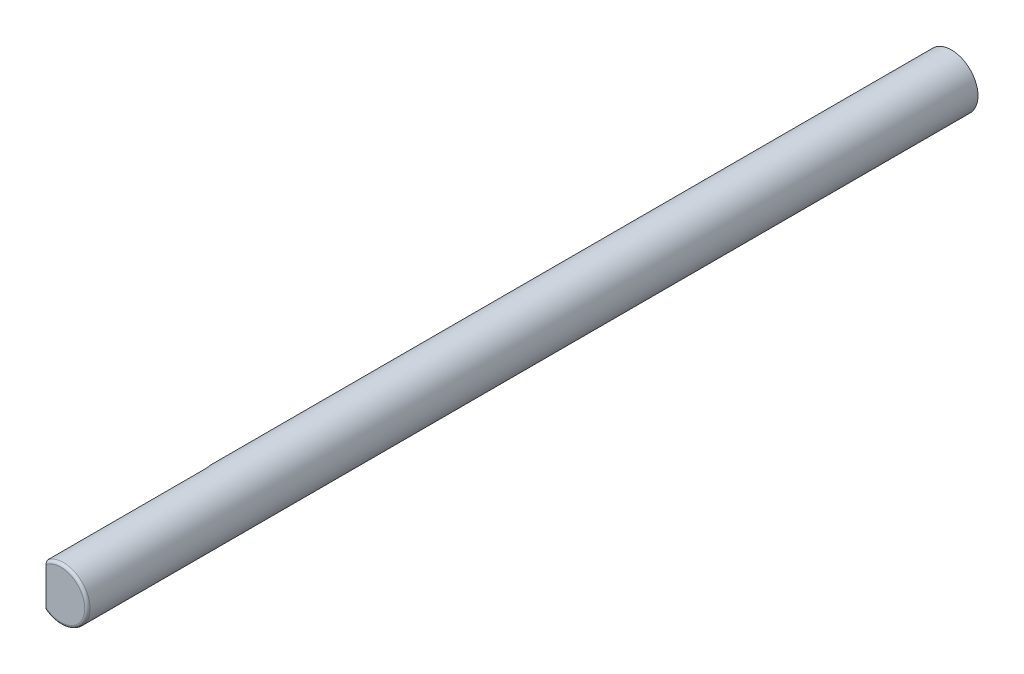
ISO-10303-21;
HEADER;
FILE_DESCRIPTION(('STEP AP214'),'2;1');
FILE_NAME('part.step','',(''),(''),'','','');
FILE_SCHEMA(('AUTOMOTIVE_DESIGN { 1 0 10303 214 1 1 1 1 }'));
ENDSEC;
DATA;
#1=APPLICATION_CONTEXT('core data for automotive mechanical design processes');
#2=APPLICATION_PROTOCOL_DEFINITION('international standard','automotive_design',2000,#1);
#3=PRODUCT_CONTEXT('',#1,'mechanical');
#4=PRODUCT('Part','Part','',(#3));
#5=PRODUCT_RELATED_PRODUCT_CATEGORY('part','',(#4));
#6=PRODUCT_DEFINITION_FORMATION('','',#4);
#7=PRODUCT_DEFINITION_CONTEXT('part definition',#1,'design');
#8=PRODUCT_DEFINITION('design','',#6,#7);
#9=PRODUCT_DEFINITION_SHAPE('','',#8);
#10=(LENGTH_UNIT() NAMED_UNIT(*) SI_UNIT(.MILLI.,.METRE.));
#11=(NAMED_UNIT(*) PLANE_ANGLE_UNIT() SI_UNIT($,.RADIAN.));
#12=(NAMED_UNIT(*) SI_UNIT($,.STERADIAN.) SOLID_ANGLE_UNIT());
#13=UNCERTAINTY_MEASURE_WITH_UNIT(LENGTH_MEASURE(1.E-05),#10,'distance_accuracy_value','');
#14=(GEOMETRIC_REPRESENTATION_CONTEXT(3) GLOBAL_UNCERTAINTY_ASSIGNED_CONTEXT((#13)) GLOBAL_UNIT_ASSIGNED_CONTEXT((#10,
#11,#12)) REPRESENTATION_CONTEXT('',''));
#15=CARTESIAN_POINT('',(0.,0.,0.));
#16=DIRECTION('',(0.,0.,1.));
#17=DIRECTION('',(1.,0.,0.));
#18=AXIS2_PLACEMENT_3D('',#15,#16,#17);
#19=CARTESIAN_POINT('',(0.,0.,84.));
#20=DIRECTION('',(0.,0.,-1.));
#21=DIRECTION('',(-1.,0.,0.));
#22=AXIS2_PLACEMENT_3D('',#19,#20,#21);
#23=CYLINDRICAL_SURFACE('',#22,2.5);
#24=CARTESIAN_POINT('',(0.,0.,0.));
#25=DIRECTION('',(0.,0.,1.));
#26=DIRECTION('',(1.,0.,0.));
#27=AXIS2_PLACEMENT_3D('',#24,#25,#26);
#28=CIRCLE('',#27,2.5);
#29=CARTESIAN_POINT('',(2.5,0.,0.));
#30=VERTEX_POINT('',#29);
#31=EDGE_CURVE('E83',#30,#30,#28,.T.);
#32=ORIENTED_EDGE('',*,*,#31,.T.);
#33=EDGE_LOOP('',(#32));
#34=FACE_BOUND('',#33,.T.);
#35=DIRECTION('',(0.,0.,-1.));
#36=VECTOR('',#35,1.);
#37=CARTESIAN_POINT('',(-1.4,2.0712315177208,84.));
#38=LINE('',#37,#36);
#39=CARTESIAN_POINT('',(-1.4,2.07123151772333,83.750000000001));
#40=VERTEX_POINT('',#39);
#41=CARTESIAN_POINT('',(-1.4,2.0712315177208,69.));
#42=VERTEX_POINT('',#41);
#43=EDGE_CURVE('E79',#40,#42,#38,.T.);
#44=ORIENTED_EDGE('',*,*,#43,.F.);
#45=CARTESIAN_POINT('',(0.,0.,83.75));
#46=DIRECTION('',(0.,0.,1.));
#47=DIRECTION('',(1.,0.,0.));
#48=AXIS2_PLACEMENT_3D('',#45,#46,#47);
#49=CIRCLE('',#48,2.5);
#50=CARTESIAN_POINT('',(-1.4,-2.07123151776407,83.7499999999845));
#51=VERTEX_POINT('',#50);
#52=EDGE_CURVE('E82',#40,#51,#49,.F.);
#53=ORIENTED_EDGE('',*,*,#52,.T.);
#54=DIRECTION('',(0.,0.,-1.));
#55=VECTOR('',#54,1.);
#56=CARTESIAN_POINT('',(-1.4,-2.0712315177208,84.));
#57=LINE('',#56,#55);
#58=CARTESIAN_POINT('',(-1.4,-2.0712315177208,69.));
#59=VERTEX_POINT('',#58);
#60=EDGE_CURVE('E59',#59,#51,#57,.F.);
#61=ORIENTED_EDGE('',*,*,#60,.F.);
#62=CARTESIAN_POINT('',(-1.4,2.0712315177208,69.));
#63=CARTESIAN_POINT('',(-1.39999849760734,2.071230026212,68.9761336321505));
#64=CARTESIAN_POINT('',(-1.4008551488557,2.07065376805564,68.9522791906795));
#65=CARTESIAN_POINT('',(-1.40426145306465,2.06834621400237,68.9047514836602));
#66=CARTESIAN_POINT('',(-1.40681083767712,2.06661510118376,68.8810781899963));
#67=CARTESIAN_POINT('',(-1.41693911021825,2.059697650857,68.8107243778241));
#68=CARTESIAN_POINT('',(-1.42699848417546,2.052787241238,68.7645353429884));
#69=CARTESIAN_POINT('',(-1.45316462908092,2.03434628246119,68.6749057138266));
#70=CARTESIAN_POINT('',(-1.46927177576743,2.02281544624079,68.6314652904634));
#71=CARTESIAN_POINT('',(-1.50660792862268,1.99516165480954,68.5484218227556));
#72=CARTESIAN_POINT('',(-1.52783743401127,1.97903825198415,68.5088191529622));
#73=CARTESIAN_POINT('',(-1.57474464069025,1.94192906346373,68.4334600120503));
#74=CARTESIAN_POINT('',(-1.60051004822206,1.92084396604997,68.3978075175362));
#75=CARTESIAN_POINT('',(-1.65476045746045,1.8743126759908,68.3318339530109));
#76=CARTESIAN_POINT('',(-1.68324681285336,1.84886430753644,68.3015155582839));
#77=CARTESIAN_POINT('',(-1.75188020240658,1.78432861963461,68.2365263708325));
#78=CARTESIAN_POINT('',(-1.79259801470348,1.74359569054774,68.2040886147845));
#79=CARTESIAN_POINT('',(-1.87373293961664,1.6561127393503,68.1482480300484));
#80=CARTESIAN_POINT('',(-1.9141494387131,1.60935281202574,68.1248603339338));
#81=CARTESIAN_POINT('',(-2.00868395747665,1.49097224184157,68.0776682724385));
#82=CARTESIAN_POINT('',(-2.06167245566697,1.41698665412497,68.0575792205504));
#83=CARTESIAN_POINT('',(-2.15998693685785,1.26211622920362,68.0278654267815));
#84=CARTESIAN_POINT('',(-2.20529362558644,1.18121476547613,68.0182667137365));
#85=CARTESIAN_POINT('',(-2.27518682931121,1.03824044791976,68.0073850582776));
#86=CARTESIAN_POINT('',(-2.3020034371994,0.977346431713889,68.0045145279523));
#87=CARTESIAN_POINT('',(-2.35072392208405,0.853535355661817,68.0009151495136));
#88=CARTESIAN_POINT('',(-2.37262582697523,0.790617495251964,68.0001871597154));
#89=CARTESIAN_POINT('',(-2.41133776392088,0.663236816952994,67.9998771329302));
#90=CARTESIAN_POINT('',(-2.42814758959221,0.598773936558105,68.0002951423839));
#91=CARTESIAN_POINT('',(-2.45656795841086,0.468725016715089,68.0014998441395));
#92=CARTESIAN_POINT('',(-2.46817917835835,0.403139124625449,68.0022864884219));
#93=CARTESIAN_POINT('',(-2.48629500567455,0.270052532778325,68.0036879932044));
#94=CARTESIAN_POINT('',(-2.49270333079678,0.202538665641398,68.0042994849443));
#95=CARTESIAN_POINT('',(-2.50001501608926,0.0672084542153271,68.0050072591245));
#96=CARTESIAN_POINT('',(-2.50091820098299,-0.000607899635807625,68.0051035251607));
#97=CARTESIAN_POINT('',(-2.49721126667906,-0.136146726712124,68.0047344925744));
#98=CARTESIAN_POINT('',(-2.4925963955963,-0.203869068669605,68.0042687099395));
#99=CARTESIAN_POINT('',(-2.47787728559477,-0.338709390708672,68.003009853324));
#100=CARTESIAN_POINT('',(-2.46777310584157,-0.405827377296271,68.0022167828711));
#101=CARTESIAN_POINT('',(-2.44166968941243,-0.541472802830017,68.0007798339144));
#102=CARTESIAN_POINT('',(-2.42546739083533,-0.60996134772772,68.000142511919));
#103=CARTESIAN_POINT('',(-2.38734056394478,-0.745353962722344,67.9998984993942));
#104=CARTESIAN_POINT('',(-2.36541438705108,-0.812257570263473,68.0002921060865));
#105=CARTESIAN_POINT('',(-2.31606035856292,-0.943815957062461,68.0032230416401));
#106=CARTESIAN_POINT('',(-2.288643687182,-1.00847499794695,68.0057560472638));
#107=CARTESIAN_POINT('',(-2.22858646003884,-1.13503422834247,68.0143345571866));
#108=CARTESIAN_POINT('',(-2.1959502673537,-1.19693666736589,68.0203771387835));
#109=CARTESIAN_POINT('',(-2.122180192478,-1.32373849224061,68.0385362468503));
#110=CARTESIAN_POINT('',(-2.08051081784006,-1.38825056412551,68.051233161495));
#111=CARTESIAN_POINT('',(-1.99267532777598,-1.51160369346607,68.0855058136959));
#112=CARTESIAN_POINT('',(-1.94651692208629,-1.57045414037393,68.1070665266445));
#113=CARTESIAN_POINT('',(-1.86164401332915,-1.66962592428561,68.1561611961749));
#114=CARTESIAN_POINT('',(-1.82330783215961,-1.71128948965173,68.181610704844));
#115=CARTESIAN_POINT('',(-1.74725608089454,-1.7888638451824,68.2408954194401));
#116=CARTESIAN_POINT('',(-1.70953987270419,-1.82478093209195,68.2747213418162));
#117=CARTESIAN_POINT('',(-1.64313851742848,-1.88461329310625,68.3449408068652));
#118=CARTESIAN_POINT('',(-1.61398037683588,-1.90953027717283,68.3800297594055));
#119=CARTESIAN_POINT('',(-1.55957119801497,-1.95422054334929,68.4560692469223));
#120=CARTESIAN_POINT('',(-1.5343194425111,-1.97399477020797,68.4970187031507));
#121=CARTESIAN_POINT('',(-1.48925213542689,-2.00821755195405,68.5841221584053));
#122=CARTESIAN_POINT('',(-1.46946172497382,-2.02264157874109,68.6302988910753));
#123=CARTESIAN_POINT('',(-1.4368361713967,-2.04594939702088,68.7263564470342));
#124=CARTESIAN_POINT('',(-1.42399490317059,-2.05483806852325,68.7762339641375));
#125=CARTESIAN_POINT('',(-1.41007156402516,-2.06439648102776,68.85550440898));
#126=CARTESIAN_POINT('',(-1.40630111414533,-2.06696205385486,68.8842332109407));
#127=CARTESIAN_POINT('',(-1.40126460084139,-2.0703770393523,68.9419691555056));
#128=CARTESIAN_POINT('',(-1.39999499231638,-2.07122888138113,68.970975845446));
#129=CARTESIAN_POINT('',(-1.4,-2.0712315177208,69.));
#130=B_SPLINE_CURVE_WITH_KNOTS('',3,(#62,#63,#64,#65,#66,#67,#68,#69,#70,#71,#72,#73,#74,#75,
#76,#77,#78,#79,#80,#81,#82,#83,#84,#85,#86,#87,#88,#89,#90,#91,#92,#93,#94,#95,#96,#97,#98,#99,
#100,#101,#102,#103,#104,#105,#106,#107,#108,#109,#110,#111,#112,#113,#114,#115,#116,#117,#118,
#119,#120,#121,#122,#123,#124,#125,#126,#127,#128,#129),.UNSPECIFIED.,.F.,.F.,(4,2,2,2,2,2,2,2,
2,2,2,2,2,2,2,2,2,2,2,2,2,2,2,2,2,2,2,2,2,2,2,2,2,4),(0.,0.0715532695161541,0.143095198438097,
0.285662258223495,0.428238176934256,0.570827996565418,0.716559703502123,0.862364294176869,
1.05956506247234,1.25709415914808,1.53513154445077,1.81385724627248,2.01341483696891,
2.21305236080002,2.4126979749028,2.61231758982238,2.81555207530805,3.01879303148235,
3.22220913514272,3.42562304636159,3.63651498052538,3.8474677225155,4.05799519420229,
4.26834759385541,4.50119263591326,4.73364461005269,4.91917153753062,5.10449375925448,
5.25978134170542,5.41504037691089,5.57100265153674,5.72682723330396,5.8139490850776,
5.90094734697915),.UNSPECIFIED.);
#131=EDGE_CURVE('E11',#42,#59,#130,.T.);
#132=ORIENTED_EDGE('',*,*,#131,.F.);
#133=EDGE_LOOP('',(#44,#53,#61,#132));
#134=FACE_BOUND('',#133,.T.);
#135=ADVANCED_FACE('F33',(#34,#134),#23,.T.);
#136=CARTESIAN_POINT('',(0.,0.,84.));
#137=DIRECTION('',(0.,0.,1.));
#138=DIRECTION('',(1.,0.,0.));
#139=AXIS2_PLACEMENT_3D('',#136,#137,#138);
#140=PLANE('',#139);
#141=CARTESIAN_POINT('',(0.,0.,84.));
#142=DIRECTION('',(0.,0.,1.));
#143=DIRECTION('',(1.,0.,0.));
#144=AXIS2_PLACEMENT_3D('',#141,#142,#143);
#145=CIRCLE('',#144,2.25);
#146=CARTESIAN_POINT('',(-1.4,-1.76139149538085,84.));
#147=VERTEX_POINT('',#146);
#148=CARTESIAN_POINT('',(-1.4,1.76139149538085,84.));
#149=VERTEX_POINT('',#148);
#150=EDGE_CURVE('E78',#147,#149,#145,.T.);
#151=ORIENTED_EDGE('',*,*,#150,.T.);
#152=DIRECTION('',(0.,-1.,0.));
#153=VECTOR('',#152,1.);
#154=CARTESIAN_POINT('',(-1.4,3.,84.));
#155=LINE('',#154,#153);
#156=EDGE_CURVE('E53',#149,#147,#155,.T.);
#157=ORIENTED_EDGE('',*,*,#156,.T.);
#158=EDGE_LOOP('',(#151,#157));
#159=FACE_BOUND('',#158,.T.);
#160=ADVANCED_FACE('F77',(#159),#140,.T.);
#161=CARTESIAN_POINT('',(0.,0.,83.75));
#162=DIRECTION('',(0.,0.,1.));
#163=DIRECTION('',(1.,0.,0.));
#164=AXIS2_PLACEMENT_3D('',#161,#162,#163);
#165=TOROIDAL_SURFACE('',#164,2.25,0.25);
#166=ORIENTED_EDGE('',*,*,#150,.F.);
#167=CARTESIAN_POINT('',(-1.4,-2.06751683308907,83.7891010855561));
#168=CARTESIAN_POINT('',(-1.4,-2.069746634839,83.777437227729));
#169=CARTESIAN_POINT('',(-1.4,-2.07098619314722,83.7655748201244));
#170=CARTESIAN_POINT('',(-1.4,-2.07141107098376,83.7418068058583));
#171=CARTESIAN_POINT('',(-1.4,-2.07059465921011,83.7299011712248));
#172=CARTESIAN_POINT('',(-1.4,-2.0669532950407,83.7064217157143));
#173=CARTESIAN_POINT('',(-1.4,-2.06413145538077,83.6948474094905));
#174=CARTESIAN_POINT('',(-1.4,-2.05662810914329,83.6723235623698));
#175=CARTESIAN_POINT('',(-1.4,-2.05194655243664,83.6613740383231));
#176=CARTESIAN_POINT('',(-1.4,-2.04080930293354,83.6400952407117));
#177=CARTESIAN_POINT('',(-1.4,-2.03431462231285,83.6297865031043));
#178=CARTESIAN_POINT('',(-1.4,-2.01986653934909,83.6102529605718));
#179=CARTESIAN_POINT('',(-1.4,-2.01191266429024,83.6010285085018));
#180=CARTESIAN_POINT('',(-1.4,-1.99375410344371,83.5827007751038));
#181=CARTESIAN_POINT('',(-1.4,-1.98339275579103,83.5737531623327));
#182=CARTESIAN_POINT('',(-1.4,-1.9615096579369,83.5574182538762));
#183=CARTESIAN_POINT('',(-1.4,-1.94998725736353,83.5500318399631));
#184=CARTESIAN_POINT('',(-1.4,-1.92398558481914,83.535664766199));
#185=CARTESIAN_POINT('',(-1.4,-1.90934196489994,83.5289819633223));
#186=CARTESIAN_POINT('',(-1.4,-1.87927037468485,83.5177232068365));
#187=CARTESIAN_POINT('',(-1.4,-1.86384195411896,83.5131484782001));
#188=CARTESIAN_POINT('',(-1.4,-1.8295083338728,83.50534262039));
#189=CARTESIAN_POINT('',(-1.4,-1.81050556367343,83.5025396438597));
#190=CARTESIAN_POINT('',(-1.4,-1.77229105082405,83.4996869685397));
#191=CARTESIAN_POINT('',(-1.4,-1.75307914527016,83.4996395965652));
#192=CARTESIAN_POINT('',(-1.4,-1.7117902214243,83.5024012227717));
#193=CARTESIAN_POINT('',(-1.4,-1.6897427077554,83.5056650155171));
#194=CARTESIAN_POINT('',(-1.4,-1.64644198331438,83.5156791685163));
#195=CARTESIAN_POINT('',(-1.4,-1.62518892017161,83.522430173364));
#196=CARTESIAN_POINT('',(-1.4,-1.58737690923002,83.5380971283731));
#197=CARTESIAN_POINT('',(-1.4,-1.5706065627723,83.5465031021878));
#198=CARTESIAN_POINT('',(-1.4,-1.53861329491592,83.5658770933205));
#199=CARTESIAN_POINT('',(-1.4,-1.52338802602704,83.57684113784));
#200=CARTESIAN_POINT('',(-1.4,-1.49897049299346,83.5981346111587));
#201=CARTESIAN_POINT('',(-1.4,-1.48925035998302,83.6078580040598));
#202=CARTESIAN_POINT('',(-1.4,-1.4714584706523,83.6287166431668));
#203=CARTESIAN_POINT('',(-1.4,-1.46338439491052,83.6398498664211));
#204=CARTESIAN_POINT('',(-1.4,-1.4507334316404,83.6611586976973));
#205=CARTESIAN_POINT('',(-1.4,-1.44578318431218,83.6711114792114));
#206=CARTESIAN_POINT('',(-1.4,-1.43759584646563,83.6917020970444));
#207=CARTESIAN_POINT('',(-1.4,-1.43435746539131,83.7023394104964));
#208=CARTESIAN_POINT('',(-1.4,-1.4298290781451,83.7240925513703));
#209=CARTESIAN_POINT('',(-1.4,-1.42855045587284,83.7352107917521));
#210=CARTESIAN_POINT('',(-1.4,-1.42809553098984,83.7574896787589));
#211=CARTESIAN_POINT('',(-1.4,-1.42891878834498,83.7686503160196));
#212=CARTESIAN_POINT('',(-1.4,-1.43241916211485,83.7896145408629));
#213=CARTESIAN_POINT('',(-1.4,-1.43491906611748,83.7994486210256));
#214=CARTESIAN_POINT('',(-1.4,-1.44141428492636,83.8186058830384));
#215=CARTESIAN_POINT('',(-1.4,-1.44541017890801,83.8279288654112));
#216=CARTESIAN_POINT('',(-1.4,-1.45621885548422,83.8488975046023));
#217=CARTESIAN_POINT('',(-1.4,-1.46352634537145,83.8602879919474));
#218=CARTESIAN_POINT('',(-1.4,-1.47989400527921,83.8817327842286));
#219=CARTESIAN_POINT('',(-1.4,-1.48895766474658,83.8917843605605));
#220=CARTESIAN_POINT('',(-1.4,-1.51172684638418,83.9137057431346));
#221=CARTESIAN_POINT('',(-1.4,-1.5259608406107,83.9250252168777));
#222=CARTESIAN_POINT('',(-1.4,-1.55604364818145,83.9452346300285));
#223=CARTESIAN_POINT('',(-1.4,-1.57189399103952,83.9541222383772));
#224=CARTESIAN_POINT('',(-1.4,-1.60509205177314,83.9697301689048));
#225=CARTESIAN_POINT('',(-1.4,-1.62246678945901,83.9763926027679));
#226=CARTESIAN_POINT('',(-1.4,-1.65795648623811,83.9872847058436));
#227=CARTESIAN_POINT('',(-1.4,-1.67607156097389,83.9915139934249));
#228=CARTESIAN_POINT('',(-1.4,-1.71668463073393,83.9981790966882));
#229=CARTESIAN_POINT('',(-1.4,-1.73928135435024,84.0000272604717));
#230=CARTESIAN_POINT('',(-1.4,-1.78448376970429,83.9999721482763));
#231=CARTESIAN_POINT('',(-1.4,-1.80708946223592,83.998068372268));
#232=CARTESIAN_POINT('',(-1.4,-1.84821950148282,83.9909004794561));
#233=CARTESIAN_POINT('',(-1.4,-1.86684068119384,83.9861928771535));
#234=CARTESIAN_POINT('',(-1.4,-1.9030649201353,83.97380006518));
#235=CARTESIAN_POINT('',(-1.4,-1.92066925601976,83.9661186867871));
#236=CARTESIAN_POINT('',(-1.4,-1.95108276070406,83.9494011757541));
#237=CARTESIAN_POINT('',(-1.4,-1.96417540630333,83.9408812900778));
#238=CARTESIAN_POINT('',(-1.4,-1.98879972897975,83.9218099295069));
#239=CARTESIAN_POINT('',(-1.4,-2.00033247871238,83.9112598628762));
#240=CARTESIAN_POINT('',(-1.4,-2.01971362853195,83.889999748638));
#241=CARTESIAN_POINT('',(-1.4,-2.02785558157892,83.8795574753407));
#242=CARTESIAN_POINT('',(-1.4,-2.0422844443968,83.8574712871667));
#243=CARTESIAN_POINT('',(-1.4,-2.0485750115816,83.8458298036274));
#244=CARTESIAN_POINT('',(-1.4,-2.05686313303344,83.8265667315097));
#245=CARTESIAN_POINT('',(-1.4,-2.05956520863061,83.8192420974961));
#246=CARTESIAN_POINT('',(-1.4,-2.06415970755473,83.8043406035764));
#247=CARTESIAN_POINT('',(-1.4,-2.0660519584504,83.7967636903237));
#248=CARTESIAN_POINT('',(-1.4,-2.06751683308907,83.7891010855561));
#249=B_SPLINE_CURVE_WITH_KNOTS('',3,(#167,#168,#169,#170,#171,#172,#173,#174,#175,#176,#177,
#178,#179,#180,#181,#182,#183,#184,#185,#186,#187,#188,#189,#190,#191,#192,#193,#194,#195,#196,
#197,#198,#199,#200,#201,#202,#203,#204,#205,#206,#207,#208,#209,#210,#211,#212,#213,#214,#215,
#216,#217,#218,#219,#220,#221,#222,#223,#224,#225,#226,#227,#228,#229,#230,#231,#232,#233,#234,
#235,#236,#237,#238,#239,#240,#241,#242,#243,#244,#245,#246,#247,#248),.UNSPECIFIED.,.T.,.F.,(4,
2,2,2,2,2,2,2,2,2,2,2,2,2,2,2,2,2,2,2,2,2,2,2,2,2,2,2,2,2,2,2,2,2,2,2,2,2,2,2,4),(0.,
0.0355961807103666,0.0712223464591754,0.106793335293137,0.142365283016352,0.178770448703528,
0.215187428979944,0.25610206295447,0.297039744316006,0.345150289814794,0.3932887565397,
0.450693683664042,0.508147082446437,0.574724248706866,0.641313725831197,0.697391627920774,
0.753383011517212,0.794490689246696,0.835540036524231,0.868754193931726,0.901943275733754,
0.935324426140196,0.968698588686469,0.999007499009386,1.02932815563994,1.06970492159056,
1.1101627530615,1.1644290795813,1.21874724217936,1.27438481822111,1.33003111846335,
1.39774216865078,1.46546224345021,1.5228586526092,1.58018135961872,1.62686222808656,
1.67351083167204,1.71307288751941,1.75255625566707,1.77593629271711,1.79932130546876),.UNSPECIFIED.);
#250=EDGE_CURVE('E46',#147,#51,#249,.T.);
#251=ORIENTED_EDGE('',*,*,#250,.T.);
#252=ORIENTED_EDGE('',*,*,#52,.F.);
#253=CARTESIAN_POINT('',(-1.4,1.42993276071515,83.7742261251651));
#254=CARTESIAN_POINT('',(-1.4,1.4284797737069,83.7635492828198));
#255=CARTESIAN_POINT('',(-1.4,1.42798224116026,83.7527308891549));
#256=CARTESIAN_POINT('',(-1.4,1.42895217107646,83.7311692769835));
#257=CARTESIAN_POINT('',(-1.4,1.43042317296387,83.7204262288915));
#258=CARTESIAN_POINT('',(-1.4,1.4351972866723,83.6994144021854));
#259=CARTESIAN_POINT('',(-1.4,1.43849176524819,83.6891436338747));
#260=CARTESIAN_POINT('',(-1.4,1.44666971777003,83.6692642515512));
#261=CARTESIAN_POINT('',(-1.4,1.45155370771529,83.6596558537912));
#262=CARTESIAN_POINT('',(-1.4,1.46444756291549,83.6382390395022));
#263=CARTESIAN_POINT('',(-1.4,1.47295744431321,83.6267322484986));
#264=CARTESIAN_POINT('',(-1.4,1.49172277952782,83.6052419199731));
#265=CARTESIAN_POINT('',(-1.4,1.50198172658523,83.5952615081257));
#266=CARTESIAN_POINT('',(-1.4,1.52752231017559,83.57368243797));
#267=CARTESIAN_POINT('',(-1.4,1.54332172700824,83.5626978240926));
#268=CARTESIAN_POINT('',(-1.4,1.5764636907251,83.543410721086));
#269=CARTESIAN_POINT('',(-1.4,1.59380751652582,83.5351104817155));
#270=CARTESIAN_POINT('',(-1.4,1.62990007353499,83.5209669260947));
#271=CARTESIAN_POINT('',(-1.4,1.64867116870904,83.5151810264129));
#272=CARTESIAN_POINT('',(-1.4,1.68684132045745,83.5063189232525));
#273=CARTESIAN_POINT('',(-1.4,1.70624056049469,83.5032435189686));
#274=CARTESIAN_POINT('',(-1.4,1.74873438637281,83.4995536950047));
#275=CARTESIAN_POINT('',(-1.4,1.77187720679287,83.4994690666402));
#276=CARTESIAN_POINT('',(-1.4,1.81784027375452,83.5033042850002));
#277=CARTESIAN_POINT('',(-1.4,1.8406606502949,83.5072224683454));
#278=CARTESIAN_POINT('',(-1.4,1.88030824440977,83.5179758414874));
#279=CARTESIAN_POINT('',(-1.4,1.89735869050309,83.5239903626366));
#280=CARTESIAN_POINT('',(-1.4,1.93025269881234,83.5387117960323));
#281=CARTESIAN_POINT('',(-1.4,1.94609799374123,83.5474147481545));
#282=CARTESIAN_POINT('',(-1.4,1.97329805283162,83.5657532706061));
#283=CARTESIAN_POINT('',(-1.4,1.98495007952569,83.5749470568571));
#284=CARTESIAN_POINT('',(-1.4,2.00659791928445,83.5951300283886));
#285=CARTESIAN_POINT('',(-1.4,2.0165939919253,83.6061189317414));
#286=CARTESIAN_POINT('',(-1.4,2.03452337916375,83.6298236204109));
#287=CARTESIAN_POINT('',(-1.4,2.04243949530355,83.64255255701));
#288=CARTESIAN_POINT('',(-1.4,2.05560314677402,83.6693255902568));
#289=CARTESIAN_POINT('',(-1.4,2.06085347256681,83.6833682933797));
#290=CARTESIAN_POINT('',(-1.4,2.06777488493682,83.7101941879195));
#291=CARTESIAN_POINT('',(-1.4,2.06984728297949,83.7228744694489));
#292=CARTESIAN_POINT('',(-1.4,2.07161875211616,83.7483975931196));
#293=CARTESIAN_POINT('',(-1.4,2.07131914533059,83.7612403407195));
#294=CARTESIAN_POINT('',(-1.4,2.06849276478409,83.7855836680409));
#295=CARTESIAN_POINT('',(-1.4,2.06615414494295,83.7971067418847));
#296=CARTESIAN_POINT('',(-1.4,2.05962450786555,83.8196121664178));
#297=CARTESIAN_POINT('',(-1.4,2.05543347758694,83.8305945132994));
#298=CARTESIAN_POINT('',(-1.4,2.04525546888173,83.8520540796839));
#299=CARTESIAN_POINT('',(-1.4,2.03922285619763,83.8625095152223));
#300=CARTESIAN_POINT('',(-1.4,2.02565875048043,83.8823937703506));
#301=CARTESIAN_POINT('',(-1.4,2.01812673296544,83.8918222289203));
#302=CARTESIAN_POINT('',(-1.4,2.00089325345193,83.9105442717815));
#303=CARTESIAN_POINT('',(-1.4,1.99104234333875,83.9196998594455));
#304=CARTESIAN_POINT('',(-1.4,1.97014066575348,83.9365135536256));
#305=CARTESIAN_POINT('',(-1.4,1.95908926581927,83.9441708647857));
#306=CARTESIAN_POINT('',(-1.4,1.93412074607394,83.9591496788247));
#307=CARTESIAN_POINT('',(-1.4,1.92003619338563,83.9661916355393));
#308=CARTESIAN_POINT('',(-1.4,1.89102703340342,83.9782429473955));
#309=CARTESIAN_POINT('',(-1.4,1.87610193650406,83.9832511036365));
#310=CARTESIAN_POINT('',(-1.4,1.84280444408958,83.9920802029752));
#311=CARTESIAN_POINT('',(-1.4,1.82432193698389,83.9954864482576));
#312=CARTESIAN_POINT('',(-1.4,1.78705897675404,83.999632953357));
#313=CARTESIAN_POINT('',(-1.4,1.76827830406451,84.0003711473871));
#314=CARTESIAN_POINT('',(-1.4,1.72766042914336,83.9991943088168));
#315=CARTESIAN_POINT('',(-1.4,1.7058358179539,83.9968162703746));
#316=CARTESIAN_POINT('',(-1.4,1.66281719964284,83.9886666111979));
#317=CARTESIAN_POINT('',(-1.4,1.64162346661543,83.982893537413));
#318=CARTESIAN_POINT('',(-1.4,1.60269978366878,83.9687692719744));
#319=CARTESIAN_POINT('',(-1.4,1.58484363630791,83.9607661895332));
#320=CARTESIAN_POINT('',(-1.4,1.55064348794347,83.9419985160101));
#321=CARTESIAN_POINT('',(-1.4,1.53429726285779,83.9312380776336));
#322=CARTESIAN_POINT('',(-1.4,1.50800360075093,83.9101738541302));
#323=CARTESIAN_POINT('',(-1.4,1.49752252074504,83.9005364541875));
#324=CARTESIAN_POINT('',(-1.4,1.4781900088246,83.8797316327081));
#325=CARTESIAN_POINT('',(-1.4,1.46933696054252,83.8685657481343));
#326=CARTESIAN_POINT('',(-1.4,1.4553866398127,83.8472169267859));
#327=CARTESIAN_POINT('',(-1.4,1.44989176924671,83.8372946061366));
#328=CARTESIAN_POINT('',(-1.4,1.440613669983,83.8166963128793));
#329=CARTESIAN_POINT('',(-1.4,1.43682518104739,83.8060227753251));
#330=CARTESIAN_POINT('',(-1.4,1.43226142431139,83.7882300777324));
#331=CARTESIAN_POINT('',(-1.4,1.43088982249655,83.7812588086625));
#332=CARTESIAN_POINT('',(-1.4,1.42993276071515,83.7742261251651));
#333=B_SPLINE_CURVE_WITH_KNOTS('',3,(#253,#254,#255,#256,#257,#258,#259,#260,#261,#262,#263,
#264,#265,#266,#267,#268,#269,#270,#271,#272,#273,#274,#275,#276,#277,#278,#279,#280,#281,#282,
#283,#284,#285,#286,#287,#288,#289,#290,#291,#292,#293,#294,#295,#296,#297,#298,#299,#300,#301,
#302,#303,#304,#305,#306,#307,#308,#309,#310,#311,#312,#313,#314,#315,#316,#317,#318,#319,#320,
#321,#322,#323,#324,#325,#326,#327,#328,#329,#330,#331,#332),.UNSPECIFIED.,.T.,.F.,(4,2,2,2,2,2,
2,2,2,2,2,2,2,2,2,2,2,2,2,2,2,2,2,2,2,2,2,2,2,2,2,2,2,2,2,2,2,2,2,4),(0.,0.0322996316278615,
0.0646574160847306,0.096863297156863,0.129079643593708,0.171780181848062,0.214567022800619,
0.271988079145316,0.329457135780382,0.388177203968,0.44691458009216,0.51601283843205,
0.585082394481332,0.639116393508079,0.693071175643631,0.737421555445708,0.78176497659083,
0.826464275056178,0.871116686793241,0.909451369851453,0.947764687228999,0.982877218288066,
1.01798999656931,1.05405527119197,1.09013318344645,1.1303253784221,1.17053885177042,
1.21760450329616,1.26469785931709,1.32086538781994,1.37707639573943,1.44266164389499,
1.50827498250886,1.5667620583001,1.62516156230648,1.66773609512107,1.71026812749146,
1.74416592260336,1.77795849403699,1.79923379987858),.UNSPECIFIED.);
#334=EDGE_CURVE('E74',#40,#149,#333,.T.);
#335=ORIENTED_EDGE('',*,*,#334,.T.);
#336=EDGE_LOOP('',(#166,#251,#252,#335));
#337=FACE_BOUND('',#336,.T.);
#338=ADVANCED_FACE('F35',(#337),#165,.T.);
#339=CARTESIAN_POINT('',(0.,0.,0.));
#340=DIRECTION('',(0.,0.,1.));
#341=DIRECTION('',(1.,0.,0.));
#342=AXIS2_PLACEMENT_3D('',#339,#340,#341);
#343=PLANE('',#342);
#344=ORIENTED_EDGE('',*,*,#31,.F.);
#345=EDGE_LOOP('',(#344));
#346=FACE_BOUND('',#345,.T.);
#347=ADVANCED_FACE('F103',(#346),#343,.F.);
#348=CARTESIAN_POINT('',(-2.4,3.,69.));
#349=DIRECTION('',(0.,-1.,0.));
#350=DIRECTION('',(0.,0.,-1.));
#351=AXIS2_PLACEMENT_3D('',#348,#349,#350);
#352=CYLINDRICAL_SURFACE('',#351,1.);
#353=ORIENTED_EDGE('',*,*,#131,.T.);
#354=DIRECTION('',(0.,-1.,0.));
#355=VECTOR('',#354,1.);
#356=CARTESIAN_POINT('',(-1.4,3.,69.));
#357=LINE('',#356,#355);
#358=EDGE_CURVE('E80',#42,#59,#357,.T.);
#359=ORIENTED_EDGE('',*,*,#358,.F.);
#360=EDGE_LOOP('',(#353,#359));
#361=FACE_BOUND('',#360,.T.);
#362=ADVANCED_FACE('F98',(#361),#352,.F.);
#363=CARTESIAN_POINT('',(-1.4,3.,84.));
#364=DIRECTION('',(-1.,0.,0.));
#365=DIRECTION('',(0.,0.,1.));
#366=AXIS2_PLACEMENT_3D('',#363,#364,#365);
#367=PLANE('',#366);
#368=ORIENTED_EDGE('',*,*,#60,.T.);
#369=ORIENTED_EDGE('',*,*,#250,.F.);
#370=ORIENTED_EDGE('',*,*,#156,.F.);
#371=ORIENTED_EDGE('',*,*,#334,.F.);
#372=ORIENTED_EDGE('',*,*,#43,.T.);
#373=ORIENTED_EDGE('',*,*,#358,.T.);
#374=EDGE_LOOP('',(#368,#369,#370,#371,#372,#373));
#375=FACE_BOUND('',#374,.T.);
#376=ADVANCED_FACE('F69',(#375),#367,.T.);
#377=CLOSED_SHELL('',(#135,#160,#338,#347,#362,#376));
#378=MANIFOLD_SOLID_BREP('B2',#377);
#379=ADVANCED_BREP_SHAPE_REPRESENTATION('',(#18,#378),#14);
#380=SHAPE_DEFINITION_REPRESENTATION(#9,#379);
ENDSEC;
END-ISO-10303-21;
